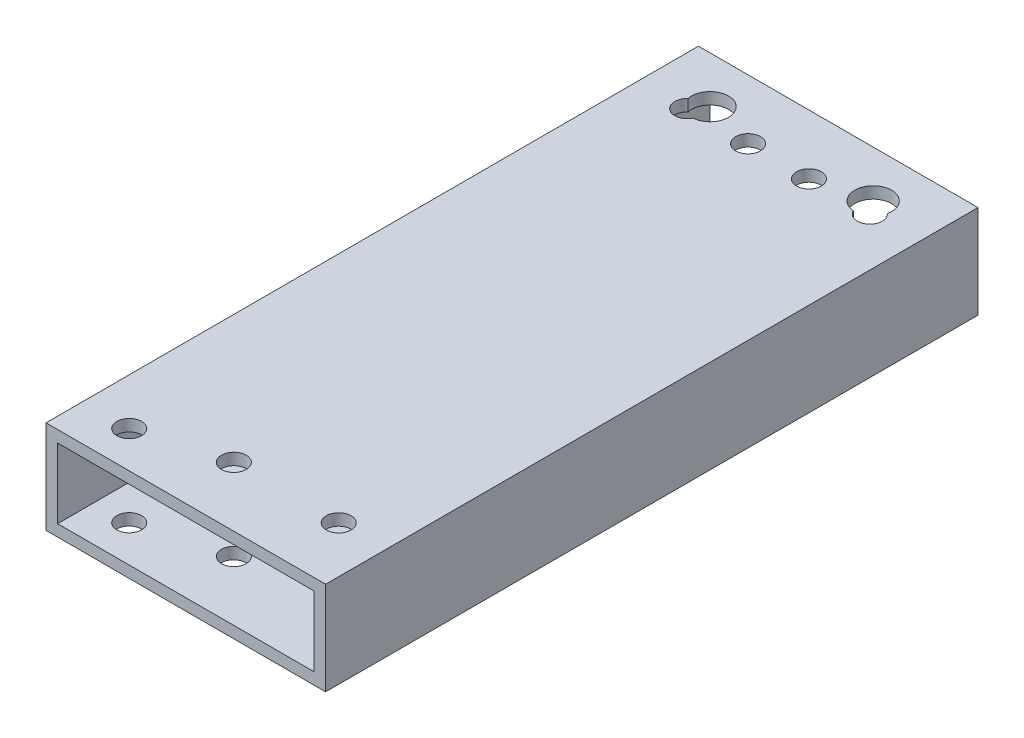
ISO-10303-21;
HEADER;
FILE_DESCRIPTION(('STEP AP214'),'2;1');
FILE_NAME('part.step','',(''),(''),'','','');
FILE_SCHEMA(('AUTOMOTIVE_DESIGN { 1 0 10303 214 1 1 1 1 }'));
ENDSEC;
DATA;
#1=APPLICATION_CONTEXT('core data for automotive mechanical design processes');
#2=APPLICATION_PROTOCOL_DEFINITION('international standard','automotive_design',2000,#1);
#3=PRODUCT_CONTEXT('',#1,'mechanical');
#4=PRODUCT('Part','Part','',(#3));
#5=PRODUCT_RELATED_PRODUCT_CATEGORY('part','',(#4));
#6=PRODUCT_DEFINITION_FORMATION('','',#4);
#7=PRODUCT_DEFINITION_CONTEXT('part definition',#1,'design');
#8=PRODUCT_DEFINITION('design','',#6,#7);
#9=PRODUCT_DEFINITION_SHAPE('','',#8);
#10=(LENGTH_UNIT() NAMED_UNIT(*) SI_UNIT(.MILLI.,.METRE.));
#11=(NAMED_UNIT(*) PLANE_ANGLE_UNIT() SI_UNIT($,.RADIAN.));
#12=(NAMED_UNIT(*) SI_UNIT($,.STERADIAN.) SOLID_ANGLE_UNIT());
#13=UNCERTAINTY_MEASURE_WITH_UNIT(LENGTH_MEASURE(1.E-05),#10,'distance_accuracy_value','');
#14=(GEOMETRIC_REPRESENTATION_CONTEXT(3) GLOBAL_UNCERTAINTY_ASSIGNED_CONTEXT((#13)) GLOBAL_UNIT_ASSIGNED_CONTEXT((#10,
#11,#12)) REPRESENTATION_CONTEXT('',''));
#15=CARTESIAN_POINT('',(0.,0.,0.));
#16=DIRECTION('',(0.,0.,1.));
#17=DIRECTION('',(1.,0.,0.));
#18=AXIS2_PLACEMENT_3D('',#15,#16,#17);
#19=CARTESIAN_POINT('',(0.,0.,177.8));
#20=DIRECTION('',(0.,0.,-1.));
#21=DIRECTION('',(-1.,0.,0.));
#22=AXIS2_PLACEMENT_3D('',#19,#20,#21);
#23=PLANE('',#22);
#24=DIRECTION('',(0.,-1.,0.));
#25=VECTOR('',#24,1.);
#26=CARTESIAN_POINT('',(0.,0.,177.8));
#27=LINE('',#26,#25);
#28=CARTESIAN_POINT('',(0.,25.4,177.8));
#29=VERTEX_POINT('',#28);
#30=CARTESIAN_POINT('',(0.,0.,177.8));
#31=VERTEX_POINT('',#30);
#32=EDGE_CURVE('E221',#29,#31,#27,.T.);
#33=ORIENTED_EDGE('',*,*,#32,.T.);
#34=DIRECTION('',(1.,0.,0.));
#35=VECTOR('',#34,1.);
#36=CARTESIAN_POINT('',(0.,0.,177.8));
#37=LINE('',#36,#35);
#38=CARTESIAN_POINT('',(76.2,0.,177.8));
#39=VERTEX_POINT('',#38);
#40=EDGE_CURVE('E224',#31,#39,#37,.T.);
#41=ORIENTED_EDGE('',*,*,#40,.T.);
#42=DIRECTION('',(0.,1.,0.));
#43=VECTOR('',#42,1.);
#44=CARTESIAN_POINT('',(76.2,0.,177.8));
#45=LINE('',#44,#43);
#46=CARTESIAN_POINT('',(76.2,25.4,177.8));
#47=VERTEX_POINT('',#46);
#48=EDGE_CURVE('E227',#39,#47,#45,.T.);
#49=ORIENTED_EDGE('',*,*,#48,.T.);
#50=DIRECTION('',(-1.,0.,0.));
#51=VECTOR('',#50,1.);
#52=CARTESIAN_POINT('',(0.,25.4,177.8));
#53=LINE('',#52,#51);
#54=EDGE_CURVE('E229',#47,#29,#53,.T.);
#55=ORIENTED_EDGE('',*,*,#54,.T.);
#56=EDGE_LOOP('',(#33,#41,#49,#55));
#57=FACE_BOUND('',#56,.T.);
#58=DIRECTION('',(0.,-1.,0.));
#59=VECTOR('',#58,1.);
#60=CARTESIAN_POINT('',(3.175,3.175,177.8));
#61=LINE('',#60,#59);
#62=CARTESIAN_POINT('',(3.175,22.225,177.8));
#63=VERTEX_POINT('',#62);
#64=CARTESIAN_POINT('',(3.175,3.175,177.8));
#65=VERTEX_POINT('',#64);
#66=EDGE_CURVE('E190',#63,#65,#61,.T.);
#67=ORIENTED_EDGE('',*,*,#66,.F.);
#68=DIRECTION('',(-1.,0.,0.));
#69=VECTOR('',#68,1.);
#70=CARTESIAN_POINT('',(3.175,22.225,177.8));
#71=LINE('',#70,#69);
#72=CARTESIAN_POINT('',(73.025,22.225,177.8));
#73=VERTEX_POINT('',#72);
#74=EDGE_CURVE('E198',#73,#63,#71,.T.);
#75=ORIENTED_EDGE('',*,*,#74,.F.);
#76=DIRECTION('',(0.,1.,0.));
#77=VECTOR('',#76,1.);
#78=CARTESIAN_POINT('',(73.025,3.175,177.8));
#79=LINE('',#78,#77);
#80=CARTESIAN_POINT('',(73.025,3.175,177.8));
#81=VERTEX_POINT('',#80);
#82=EDGE_CURVE('E195',#81,#73,#79,.T.);
#83=ORIENTED_EDGE('',*,*,#82,.F.);
#84=DIRECTION('',(1.,0.,0.));
#85=VECTOR('',#84,1.);
#86=CARTESIAN_POINT('',(3.175,3.175,177.8));
#87=LINE('',#86,#85);
#88=EDGE_CURVE('E192',#65,#81,#87,.T.);
#89=ORIENTED_EDGE('',*,*,#88,.F.);
#90=EDGE_LOOP('',(#67,#75,#83,#89));
#91=FACE_BOUND('',#90,.T.);
#92=ADVANCED_FACE('F32',(#57,#91),#23,.F.);
#93=CARTESIAN_POINT('',(0.,0.,0.));
#94=DIRECTION('',(0.,0.,-1.));
#95=DIRECTION('',(-1.,0.,0.));
#96=AXIS2_PLACEMENT_3D('',#93,#94,#95);
#97=PLANE('',#96);
#98=DIRECTION('',(0.,-1.,0.));
#99=VECTOR('',#98,1.);
#100=CARTESIAN_POINT('',(0.,0.,0.));
#101=LINE('',#100,#99);
#102=CARTESIAN_POINT('',(0.,25.4,0.));
#103=VERTEX_POINT('',#102);
#104=CARTESIAN_POINT('',(0.,0.,0.));
#105=VERTEX_POINT('',#104);
#106=EDGE_CURVE('E220',#103,#105,#101,.T.);
#107=ORIENTED_EDGE('',*,*,#106,.F.);
#108=DIRECTION('',(-1.,0.,0.));
#109=VECTOR('',#108,1.);
#110=CARTESIAN_POINT('',(0.,25.4,0.));
#111=LINE('',#110,#109);
#112=CARTESIAN_POINT('',(76.2,25.4,0.));
#113=VERTEX_POINT('',#112);
#114=EDGE_CURVE('E225',#113,#103,#111,.T.);
#115=ORIENTED_EDGE('',*,*,#114,.F.);
#116=DIRECTION('',(0.,1.,0.));
#117=VECTOR('',#116,1.);
#118=CARTESIAN_POINT('',(76.2,0.,0.));
#119=LINE('',#118,#117);
#120=CARTESIAN_POINT('',(76.2,0.,0.));
#121=VERTEX_POINT('',#120);
#122=EDGE_CURVE('E236',#121,#113,#119,.T.);
#123=ORIENTED_EDGE('',*,*,#122,.F.);
#124=DIRECTION('',(1.,0.,0.));
#125=VECTOR('',#124,1.);
#126=CARTESIAN_POINT('',(0.,0.,0.));
#127=LINE('',#126,#125);
#128=EDGE_CURVE('E234',#105,#121,#127,.T.);
#129=ORIENTED_EDGE('',*,*,#128,.F.);
#130=EDGE_LOOP('',(#107,#115,#123,#129));
#131=FACE_BOUND('',#130,.T.);
#132=DIRECTION('',(-1.,0.,0.));
#133=VECTOR('',#132,1.);
#134=CARTESIAN_POINT('',(3.175,22.225,0.));
#135=LINE('',#134,#133);
#136=CARTESIAN_POINT('',(73.025,22.225,0.));
#137=VERTEX_POINT('',#136);
#138=CARTESIAN_POINT('',(3.175,22.225,0.));
#139=VERTEX_POINT('',#138);
#140=EDGE_CURVE('E193',#137,#139,#135,.T.);
#141=ORIENTED_EDGE('',*,*,#140,.T.);
#142=DIRECTION('',(0.,-1.,0.));
#143=VECTOR('',#142,1.);
#144=CARTESIAN_POINT('',(3.175,3.175,0.));
#145=LINE('',#144,#143);
#146=CARTESIAN_POINT('',(3.175,3.175,0.));
#147=VERTEX_POINT('',#146);
#148=EDGE_CURVE('E189',#139,#147,#145,.T.);
#149=ORIENTED_EDGE('',*,*,#148,.T.);
#150=DIRECTION('',(1.,0.,0.));
#151=VECTOR('',#150,1.);
#152=CARTESIAN_POINT('',(3.175,3.175,0.));
#153=LINE('',#152,#151);
#154=CARTESIAN_POINT('',(73.025,3.175,0.));
#155=VERTEX_POINT('',#154);
#156=EDGE_CURVE('E203',#147,#155,#153,.T.);
#157=ORIENTED_EDGE('',*,*,#156,.T.);
#158=DIRECTION('',(0.,1.,0.));
#159=VECTOR('',#158,1.);
#160=CARTESIAN_POINT('',(73.025,3.175,0.));
#161=LINE('',#160,#159);
#162=EDGE_CURVE('E206',#155,#137,#161,.T.);
#163=ORIENTED_EDGE('',*,*,#162,.T.);
#164=EDGE_LOOP('',(#141,#149,#157,#163));
#165=FACE_BOUND('',#164,.T.);
#166=ADVANCED_FACE('F352',(#131,#165),#97,.T.);
#167=CARTESIAN_POINT('',(0.,0.,177.8));
#168=DIRECTION('',(1.,0.,0.));
#169=DIRECTION('',(0.,0.,-1.));
#170=AXIS2_PLACEMENT_3D('',#167,#168,#169);
#171=PLANE('',#170);
#172=ORIENTED_EDGE('',*,*,#106,.T.);
#173=DIRECTION('',(0.,0.,-1.));
#174=VECTOR('',#173,1.);
#175=CARTESIAN_POINT('',(0.,0.,177.8));
#176=LINE('',#175,#174);
#177=EDGE_CURVE('E247',#31,#105,#176,.T.);
#178=ORIENTED_EDGE('',*,*,#177,.F.);
#179=ORIENTED_EDGE('',*,*,#32,.F.);
#180=DIRECTION('',(0.,0.,-1.));
#181=VECTOR('',#180,1.);
#182=CARTESIAN_POINT('',(0.,25.4,177.8));
#183=LINE('',#182,#181);
#184=EDGE_CURVE('E231',#29,#103,#183,.T.);
#185=ORIENTED_EDGE('',*,*,#184,.T.);
#186=EDGE_LOOP('',(#172,#178,#179,#185));
#187=FACE_BOUND('',#186,.T.);
#188=ADVANCED_FACE('F34',(#187),#171,.F.);
#189=CARTESIAN_POINT('',(0.,0.,177.8));
#190=DIRECTION('',(0.,1.,0.));
#191=DIRECTION('',(0.,0.,1.));
#192=AXIS2_PLACEMENT_3D('',#189,#190,#191);
#193=PLANE('',#192);
#194=CARTESIAN_POINT('',(34.925,0.,161.531300000001));
#195=DIRECTION('',(0.,1.,0.));
#196=DIRECTION('',(0.,0.,1.));
#197=AXIS2_PLACEMENT_3D('',#194,#195,#196);
#198=CIRCLE('',#197,3.37819999999999);
#199=CARTESIAN_POINT('',(34.925,0.,164.909500000001));
#200=VERTEX_POINT('',#199);
#201=EDGE_CURVE('E273',#200,#200,#198,.T.);
#202=ORIENTED_EDGE('',*,*,#201,.T.);
#203=EDGE_LOOP('',(#202));
#204=FACE_BOUND('',#203,.T.);
#205=CARTESIAN_POINT('',(63.5000000000005,0.,161.531300000001));
#206=DIRECTION('',(0.,1.,0.));
#207=DIRECTION('',(0.,0.,1.));
#208=AXIS2_PLACEMENT_3D('',#205,#206,#207);
#209=CIRCLE('',#208,3.3782);
#210=CARTESIAN_POINT('',(63.5000000000005,0.,164.909500000001));
#211=VERTEX_POINT('',#210);
#212=EDGE_CURVE('E268',#211,#211,#209,.T.);
#213=ORIENTED_EDGE('',*,*,#212,.T.);
#214=EDGE_LOOP('',(#213));
#215=FACE_BOUND('',#214,.T.);
#216=CARTESIAN_POINT('',(12.6999999999994,0.,167.819500474202));
#217=DIRECTION('',(0.,-1.,0.));
#218=DIRECTION('',(0.,0.,-1.));
#219=AXIS2_PLACEMENT_3D('',#216,#217,#218);
#220=CIRCLE('',#219,3.37819999999999);
#221=CARTESIAN_POINT('',(12.6999999999994,0.,164.441300474202));
#222=VERTEX_POINT('',#221);
#223=EDGE_CURVE('E318',#222,#222,#220,.T.);
#224=ORIENTED_EDGE('',*,*,#223,.F.);
#225=EDGE_LOOP('',(#224));
#226=FACE_BOUND('',#225,.T.);
#227=CARTESIAN_POINT('',(29.80436,0.,16.2687));
#228=DIRECTION('',(0.,1.,0.));
#229=DIRECTION('',(0.,0.,1.));
#230=AXIS2_PLACEMENT_3D('',#227,#228,#229);
#231=CIRCLE('',#230,3.3782);
#232=CARTESIAN_POINT('',(29.80436,0.,19.6469));
#233=VERTEX_POINT('',#232);
#234=EDGE_CURVE('E255',#233,#233,#231,.T.);
#235=ORIENTED_EDGE('',*,*,#234,.T.);
#236=EDGE_LOOP('',(#235));
#237=FACE_BOUND('',#236,.T.);
#238=CARTESIAN_POINT('',(46.39564,0.,16.2687));
#239=DIRECTION('',(0.,1.,0.));
#240=DIRECTION('',(0.,0.,1.));
#241=AXIS2_PLACEMENT_3D('',#238,#239,#240);
#242=CIRCLE('',#241,3.3782);
#243=CARTESIAN_POINT('',(46.39564,0.,19.6469));
#244=VERTEX_POINT('',#243);
#245=EDGE_CURVE('E161',#244,#244,#242,.T.);
#246=ORIENTED_EDGE('',*,*,#245,.T.);
#247=EDGE_LOOP('',(#246));
#248=FACE_BOUND('',#247,.T.);
#249=CARTESIAN_POINT('',(62.98692,0.,16.2687));
#250=DIRECTION('',(0.,1.,0.));
#251=DIRECTION('',(0.,0.,1.));
#252=AXIS2_PLACEMENT_3D('',#249,#250,#251);
#253=CIRCLE('',#252,3.37820000000001);
#254=CARTESIAN_POINT('',(59.9397696653714,0.,17.7271615449756));
#255=VERTEX_POINT('',#254);
#256=CARTESIAN_POINT('',(65.2534245874837,0.,13.7636666279837));
#257=VERTEX_POINT('',#256);
#258=EDGE_CURVE('E153',#255,#257,#253,.T.);
#259=ORIENTED_EDGE('',*,*,#258,.T.);
#260=CARTESIAN_POINT('',(60.325,0.,12.7));
#261=DIRECTION('',(0.,-1.,0.));
#262=DIRECTION('',(0.,0.,-1.));
#263=AXIS2_PLACEMENT_3D('',#260,#261,#262);
#264=CIRCLE('',#263,5.04189999999999);
#265=EDGE_CURVE('E55',#255,#257,#264,.T.);
#266=ORIENTED_EDGE('',*,*,#265,.F.);
#267=EDGE_LOOP('',(#259,#266));
#268=FACE_BOUND('',#267,.T.);
#269=CARTESIAN_POINT('',(13.21308,0.,16.2687));
#270=DIRECTION('',(0.,1.,0.));
#271=DIRECTION('',(0.,0.,1.));
#272=AXIS2_PLACEMENT_3D('',#269,#270,#271);
#273=CIRCLE('',#272,3.3782);
#274=CARTESIAN_POINT('',(10.9465754125163,0.,13.7636666279837));
#275=VERTEX_POINT('',#274);
#276=CARTESIAN_POINT('',(16.2602303346286,0.,17.7271615449756));
#277=VERTEX_POINT('',#276);
#278=EDGE_CURVE('E180',#275,#277,#273,.T.);
#279=ORIENTED_EDGE('',*,*,#278,.T.);
#280=CARTESIAN_POINT('',(15.875,0.,12.7));
#281=DIRECTION('',(0.,-1.,0.));
#282=DIRECTION('',(0.,0.,-1.));
#283=AXIS2_PLACEMENT_3D('',#280,#281,#282);
#284=CIRCLE('',#283,5.0419);
#285=EDGE_CURVE('E296',#275,#277,#284,.T.);
#286=ORIENTED_EDGE('',*,*,#285,.F.);
#287=EDGE_LOOP('',(#279,#286));
#288=FACE_BOUND('',#287,.T.);
#289=ORIENTED_EDGE('',*,*,#128,.T.);
#290=DIRECTION('',(0.,0.,-1.));
#291=VECTOR('',#290,1.);
#292=CARTESIAN_POINT('',(76.2,0.,177.8));
#293=LINE('',#292,#291);
#294=EDGE_CURVE('E244',#39,#121,#293,.T.);
#295=ORIENTED_EDGE('',*,*,#294,.F.);
#296=ORIENTED_EDGE('',*,*,#40,.F.);
#297=ORIENTED_EDGE('',*,*,#177,.T.);
#298=EDGE_LOOP('',(#289,#295,#296,#297));
#299=FACE_BOUND('',#298,.T.);
#300=ADVANCED_FACE('F151',(#204,#215,#226,#237,#248,#268,#288,#299),#193,.F.);
#301=CARTESIAN_POINT('',(76.2,0.,177.8));
#302=DIRECTION('',(-1.,0.,0.));
#303=DIRECTION('',(0.,0.,1.));
#304=AXIS2_PLACEMENT_3D('',#301,#302,#303);
#305=PLANE('',#304);
#306=ORIENTED_EDGE('',*,*,#122,.T.);
#307=DIRECTION('',(0.,0.,-1.));
#308=VECTOR('',#307,1.);
#309=CARTESIAN_POINT('',(76.2,25.4,177.8));
#310=LINE('',#309,#308);
#311=EDGE_CURVE('E241',#47,#113,#310,.T.);
#312=ORIENTED_EDGE('',*,*,#311,.F.);
#313=ORIENTED_EDGE('',*,*,#48,.F.);
#314=ORIENTED_EDGE('',*,*,#294,.T.);
#315=EDGE_LOOP('',(#306,#312,#313,#314));
#316=FACE_BOUND('',#315,.T.);
#317=ADVANCED_FACE('F368',(#316),#305,.F.);
#318=CARTESIAN_POINT('',(0.,25.4,177.8));
#319=DIRECTION('',(0.,-1.,0.));
#320=DIRECTION('',(0.,0.,-1.));
#321=AXIS2_PLACEMENT_3D('',#318,#319,#320);
#322=PLANE('',#321);
#323=CARTESIAN_POINT('',(34.925,25.4,161.531300000001));
#324=DIRECTION('',(0.,1.,0.));
#325=DIRECTION('',(0.,0.,1.));
#326=AXIS2_PLACEMENT_3D('',#323,#324,#325);
#327=CIRCLE('',#326,3.37819999999999);
#328=CARTESIAN_POINT('',(34.925,25.4,164.909500000001));
#329=VERTEX_POINT('',#328);
#330=EDGE_CURVE('E304',#329,#329,#327,.T.);
#331=ORIENTED_EDGE('',*,*,#330,.F.);
#332=EDGE_LOOP('',(#331));
#333=FACE_BOUND('',#332,.T.);
#334=CARTESIAN_POINT('',(63.5000000000005,25.4,161.531300000001));
#335=DIRECTION('',(0.,1.,0.));
#336=DIRECTION('',(0.,0.,1.));
#337=AXIS2_PLACEMENT_3D('',#334,#335,#336);
#338=CIRCLE('',#337,3.3782);
#339=CARTESIAN_POINT('',(63.5000000000005,25.4,164.909500000001));
#340=VERTEX_POINT('',#339);
#341=EDGE_CURVE('E311',#340,#340,#338,.T.);
#342=ORIENTED_EDGE('',*,*,#341,.F.);
#343=EDGE_LOOP('',(#342));
#344=FACE_BOUND('',#343,.T.);
#345=CARTESIAN_POINT('',(12.6999999999994,25.4,167.819500474202));
#346=DIRECTION('',(0.,-1.,0.));
#347=DIRECTION('',(0.,0.,-1.));
#348=AXIS2_PLACEMENT_3D('',#345,#346,#347);
#349=CIRCLE('',#348,3.37819999999999);
#350=CARTESIAN_POINT('',(12.6999999999994,25.4,164.441300474202));
#351=VERTEX_POINT('',#350);
#352=EDGE_CURVE('E263',#351,#351,#349,.T.);
#353=ORIENTED_EDGE('',*,*,#352,.T.);
#354=EDGE_LOOP('',(#353));
#355=FACE_BOUND('',#354,.T.);
#356=CARTESIAN_POINT('',(29.80436,25.4,16.2687));
#357=DIRECTION('',(0.,1.,0.));
#358=DIRECTION('',(0.,0.,1.));
#359=AXIS2_PLACEMENT_3D('',#356,#357,#358);
#360=CIRCLE('',#359,3.3782);
#361=CARTESIAN_POINT('',(29.80436,25.4,19.6469));
#362=VERTEX_POINT('',#361);
#363=EDGE_CURVE('E327',#362,#362,#360,.T.);
#364=ORIENTED_EDGE('',*,*,#363,.F.);
#365=EDGE_LOOP('',(#364));
#366=FACE_BOUND('',#365,.T.);
#367=CARTESIAN_POINT('',(46.39564,25.4,16.2687));
#368=DIRECTION('',(0.,1.,0.));
#369=DIRECTION('',(0.,0.,1.));
#370=AXIS2_PLACEMENT_3D('',#367,#368,#369);
#371=CIRCLE('',#370,3.3782);
#372=CARTESIAN_POINT('',(46.39564,25.4,19.6469));
#373=VERTEX_POINT('',#372);
#374=EDGE_CURVE('E157',#373,#373,#371,.T.);
#375=ORIENTED_EDGE('',*,*,#374,.F.);
#376=EDGE_LOOP('',(#375));
#377=FACE_BOUND('',#376,.T.);
#378=CARTESIAN_POINT('',(62.98692,25.4,16.2687));
#379=DIRECTION('',(0.,1.,0.));
#380=DIRECTION('',(0.,0.,1.));
#381=AXIS2_PLACEMENT_3D('',#378,#379,#380);
#382=CIRCLE('',#381,3.37820000000001);
#383=CARTESIAN_POINT('',(59.9397696653714,25.4,17.7271615449756));
#384=VERTEX_POINT('',#383);
#385=CARTESIAN_POINT('',(65.2534245874837,25.4,13.7636666279837));
#386=VERTEX_POINT('',#385);
#387=EDGE_CURVE('E158',#384,#386,#382,.T.);
#388=ORIENTED_EDGE('',*,*,#387,.F.);
#389=CARTESIAN_POINT('',(60.325,25.4,12.7));
#390=DIRECTION('',(0.,-1.,0.));
#391=DIRECTION('',(0.,0.,-1.));
#392=AXIS2_PLACEMENT_3D('',#389,#390,#391);
#393=CIRCLE('',#392,5.04189999999999);
#394=EDGE_CURVE('E154',#384,#386,#393,.T.);
#395=ORIENTED_EDGE('',*,*,#394,.T.);
#396=EDGE_LOOP('',(#388,#395));
#397=FACE_BOUND('',#396,.T.);
#398=CARTESIAN_POINT('',(13.21308,25.4,16.2687));
#399=DIRECTION('',(0.,1.,0.));
#400=DIRECTION('',(0.,0.,1.));
#401=AXIS2_PLACEMENT_3D('',#398,#399,#400);
#402=CIRCLE('',#401,3.3782);
#403=CARTESIAN_POINT('',(10.9465754125163,25.4,13.7636666279837));
#404=VERTEX_POINT('',#403);
#405=CARTESIAN_POINT('',(16.2602303346286,25.4,17.7271615449756));
#406=VERTEX_POINT('',#405);
#407=EDGE_CURVE('E179',#404,#406,#402,.T.);
#408=ORIENTED_EDGE('',*,*,#407,.F.);
#409=CARTESIAN_POINT('',(15.875,25.4,12.7));
#410=DIRECTION('',(0.,-1.,0.));
#411=DIRECTION('',(0.,0.,-1.));
#412=AXIS2_PLACEMENT_3D('',#409,#410,#411);
#413=CIRCLE('',#412,5.0419);
#414=EDGE_CURVE('E290',#404,#406,#413,.T.);
#415=ORIENTED_EDGE('',*,*,#414,.T.);
#416=EDGE_LOOP('',(#408,#415));
#417=FACE_BOUND('',#416,.T.);
#418=ORIENTED_EDGE('',*,*,#114,.T.);
#419=ORIENTED_EDGE('',*,*,#184,.F.);
#420=ORIENTED_EDGE('',*,*,#54,.F.);
#421=ORIENTED_EDGE('',*,*,#311,.T.);
#422=EDGE_LOOP('',(#418,#419,#420,#421));
#423=FACE_BOUND('',#422,.T.);
#424=ADVANCED_FACE('F365',(#333,#344,#355,#366,#377,#397,#417,#423),#322,.F.);
#425=CARTESIAN_POINT('',(3.175,3.175,177.8));
#426=DIRECTION('',(1.,0.,0.));
#427=DIRECTION('',(0.,0.,-1.));
#428=AXIS2_PLACEMENT_3D('',#425,#426,#427);
#429=PLANE('',#428);
#430=ORIENTED_EDGE('',*,*,#148,.F.);
#431=DIRECTION('',(0.,0.,-1.));
#432=VECTOR('',#431,1.);
#433=CARTESIAN_POINT('',(3.175,22.225,177.8));
#434=LINE('',#433,#432);
#435=EDGE_CURVE('E200',#63,#139,#434,.T.);
#436=ORIENTED_EDGE('',*,*,#435,.F.);
#437=ORIENTED_EDGE('',*,*,#66,.T.);
#438=DIRECTION('',(0.,0.,-1.));
#439=VECTOR('',#438,1.);
#440=CARTESIAN_POINT('',(3.175,3.175,177.8));
#441=LINE('',#440,#439);
#442=EDGE_CURVE('E217',#65,#147,#441,.T.);
#443=ORIENTED_EDGE('',*,*,#442,.T.);
#444=EDGE_LOOP('',(#430,#436,#437,#443));
#445=FACE_BOUND('',#444,.T.);
#446=ADVANCED_FACE('F362',(#445),#429,.T.);
#447=CARTESIAN_POINT('',(3.175,3.175,177.8));
#448=DIRECTION('',(0.,1.,0.));
#449=DIRECTION('',(0.,0.,1.));
#450=AXIS2_PLACEMENT_3D('',#447,#448,#449);
#451=PLANE('',#450);
#452=CARTESIAN_POINT('',(60.325,3.175,12.7));
#453=DIRECTION('',(0.,1.,0.));
#454=DIRECTION('',(0.,0.,1.));
#455=AXIS2_PLACEMENT_3D('',#452,#453,#454);
#456=CIRCLE('',#455,5.04189999999999);
#457=CARTESIAN_POINT('',(65.2534245874837,3.175,13.7636666279837));
#458=VERTEX_POINT('',#457);
#459=CARTESIAN_POINT('',(59.9397696653714,3.175,17.7271615449756));
#460=VERTEX_POINT('',#459);
#461=EDGE_CURVE('E144',#458,#460,#456,.T.);
#462=ORIENTED_EDGE('',*,*,#461,.F.);
#463=CARTESIAN_POINT('',(62.98692,3.175,16.2687));
#464=DIRECTION('',(0.,1.,0.));
#465=DIRECTION('',(0.,0.,1.));
#466=AXIS2_PLACEMENT_3D('',#463,#464,#465);
#467=CIRCLE('',#466,3.37820000000001);
#468=EDGE_CURVE('E168',#460,#458,#467,.T.);
#469=ORIENTED_EDGE('',*,*,#468,.F.);
#470=EDGE_LOOP('',(#462,#469));
#471=FACE_BOUND('',#470,.T.);
#472=CARTESIAN_POINT('',(15.875,3.175,12.7));
#473=DIRECTION('',(0.,1.,0.));
#474=DIRECTION('',(0.,0.,1.));
#475=AXIS2_PLACEMENT_3D('',#472,#473,#474);
#476=CIRCLE('',#475,5.0419);
#477=CARTESIAN_POINT('',(16.2602303346286,3.175,17.7271615449756));
#478=VERTEX_POINT('',#477);
#479=CARTESIAN_POINT('',(10.9465754125163,3.175,13.7636666279837));
#480=VERTEX_POINT('',#479);
#481=EDGE_CURVE('E288',#478,#480,#476,.T.);
#482=ORIENTED_EDGE('',*,*,#481,.F.);
#483=CARTESIAN_POINT('',(13.21308,3.175,16.2687));
#484=DIRECTION('',(0.,1.,0.));
#485=DIRECTION('',(0.,0.,1.));
#486=AXIS2_PLACEMENT_3D('',#483,#484,#485);
#487=CIRCLE('',#486,3.3782);
#488=EDGE_CURVE('E186',#480,#478,#487,.T.);
#489=ORIENTED_EDGE('',*,*,#488,.F.);
#490=EDGE_LOOP('',(#482,#489));
#491=FACE_BOUND('',#490,.T.);
#492=CARTESIAN_POINT('',(34.925,3.175,161.531300000001));
#493=DIRECTION('',(0.,1.,0.));
#494=DIRECTION('',(0.,0.,1.));
#495=AXIS2_PLACEMENT_3D('',#492,#493,#494);
#496=CIRCLE('',#495,3.37819999999999);
#497=CARTESIAN_POINT('',(34.925,3.175,164.909500000001));
#498=VERTEX_POINT('',#497);
#499=EDGE_CURVE('E272',#498,#498,#496,.T.);
#500=ORIENTED_EDGE('',*,*,#499,.F.);
#501=EDGE_LOOP('',(#500));
#502=FACE_BOUND('',#501,.T.);
#503=CARTESIAN_POINT('',(63.5000000000005,3.175,161.531300000001));
#504=DIRECTION('',(0.,1.,0.));
#505=DIRECTION('',(0.,0.,1.));
#506=AXIS2_PLACEMENT_3D('',#503,#504,#505);
#507=CIRCLE('',#506,3.3782);
#508=CARTESIAN_POINT('',(63.5000000000005,3.175,164.909500000001));
#509=VERTEX_POINT('',#508);
#510=EDGE_CURVE('E267',#509,#509,#507,.T.);
#511=ORIENTED_EDGE('',*,*,#510,.F.);
#512=EDGE_LOOP('',(#511));
#513=FACE_BOUND('',#512,.T.);
#514=CARTESIAN_POINT('',(12.6999999999994,3.175,167.819500474202));
#515=DIRECTION('',(0.,1.,0.));
#516=DIRECTION('',(0.,0.,1.));
#517=AXIS2_PLACEMENT_3D('',#514,#515,#516);
#518=CIRCLE('',#517,3.37819999999999);
#519=CARTESIAN_POINT('',(12.6999999999994,3.175,171.197700474202));
#520=VERTEX_POINT('',#519);
#521=EDGE_CURVE('E164',#520,#520,#518,.T.);
#522=ORIENTED_EDGE('',*,*,#521,.F.);
#523=EDGE_LOOP('',(#522));
#524=FACE_BOUND('',#523,.T.);
#525=CARTESIAN_POINT('',(29.80436,3.175,16.2687));
#526=DIRECTION('',(0.,1.,0.));
#527=DIRECTION('',(0.,0.,1.));
#528=AXIS2_PLACEMENT_3D('',#525,#526,#527);
#529=CIRCLE('',#528,3.3782);
#530=CARTESIAN_POINT('',(29.80436,3.175,19.6469));
#531=VERTEX_POINT('',#530);
#532=EDGE_CURVE('E176',#531,#531,#529,.T.);
#533=ORIENTED_EDGE('',*,*,#532,.F.);
#534=EDGE_LOOP('',(#533));
#535=FACE_BOUND('',#534,.T.);
#536=CARTESIAN_POINT('',(46.39564,3.175,16.2687));
#537=DIRECTION('',(0.,1.,0.));
#538=DIRECTION('',(0.,0.,1.));
#539=AXIS2_PLACEMENT_3D('',#536,#537,#538);
#540=CIRCLE('',#539,3.3782);
#541=CARTESIAN_POINT('',(46.39564,3.175,19.6469));
#542=VERTEX_POINT('',#541);
#543=EDGE_CURVE('E172',#542,#542,#540,.T.);
#544=ORIENTED_EDGE('',*,*,#543,.F.);
#545=EDGE_LOOP('',(#544));
#546=FACE_BOUND('',#545,.T.);
#547=ORIENTED_EDGE('',*,*,#156,.F.);
#548=ORIENTED_EDGE('',*,*,#442,.F.);
#549=ORIENTED_EDGE('',*,*,#88,.T.);
#550=DIRECTION('',(0.,0.,-1.));
#551=VECTOR('',#550,1.);
#552=CARTESIAN_POINT('',(73.025,3.175,177.8));
#553=LINE('',#552,#551);
#554=EDGE_CURVE('E215',#81,#155,#553,.T.);
#555=ORIENTED_EDGE('',*,*,#554,.T.);
#556=EDGE_LOOP('',(#547,#548,#549,#555));
#557=FACE_BOUND('',#556,.T.);
#558=ADVANCED_FACE('F286',(#471,#491,#502,#513,#524,#535,#546,#557),#451,.T.);
#559=CARTESIAN_POINT('',(73.025,3.175,177.8));
#560=DIRECTION('',(-1.,0.,0.));
#561=DIRECTION('',(0.,0.,1.));
#562=AXIS2_PLACEMENT_3D('',#559,#560,#561);
#563=PLANE('',#562);
#564=ORIENTED_EDGE('',*,*,#162,.F.);
#565=ORIENTED_EDGE('',*,*,#554,.F.);
#566=ORIENTED_EDGE('',*,*,#82,.T.);
#567=DIRECTION('',(0.,0.,-1.));
#568=VECTOR('',#567,1.);
#569=CARTESIAN_POINT('',(73.025,22.225,177.8));
#570=LINE('',#569,#568);
#571=EDGE_CURVE('E213',#73,#137,#570,.T.);
#572=ORIENTED_EDGE('',*,*,#571,.T.);
#573=EDGE_LOOP('',(#564,#565,#566,#572));
#574=FACE_BOUND('',#573,.T.);
#575=ADVANCED_FACE('F443',(#574),#563,.T.);
#576=CARTESIAN_POINT('',(3.175,22.225,177.8));
#577=DIRECTION('',(0.,-1.,0.));
#578=DIRECTION('',(0.,0.,-1.));
#579=AXIS2_PLACEMENT_3D('',#576,#577,#578);
#580=PLANE('',#579);
#581=CARTESIAN_POINT('',(60.325,22.225,12.7));
#582=DIRECTION('',(0.,-1.,0.));
#583=DIRECTION('',(0.,0.,-1.));
#584=AXIS2_PLACEMENT_3D('',#581,#582,#583);
#585=CIRCLE('',#584,5.04189999999999);
#586=CARTESIAN_POINT('',(59.9397696653714,22.225,17.7271615449756));
#587=VERTEX_POINT('',#586);
#588=CARTESIAN_POINT('',(65.2534245874837,22.225,13.7636666279837));
#589=VERTEX_POINT('',#588);
#590=EDGE_CURVE('E47',#587,#589,#585,.T.);
#591=ORIENTED_EDGE('',*,*,#590,.F.);
#592=CARTESIAN_POINT('',(62.98692,22.225,16.2687));
#593=DIRECTION('',(0.,-1.,0.));
#594=DIRECTION('',(0.,0.,-1.));
#595=AXIS2_PLACEMENT_3D('',#592,#593,#594);
#596=CIRCLE('',#595,3.37820000000001);
#597=EDGE_CURVE('E171',#589,#587,#596,.T.);
#598=ORIENTED_EDGE('',*,*,#597,.F.);
#599=EDGE_LOOP('',(#591,#598));
#600=FACE_BOUND('',#599,.T.);
#601=CARTESIAN_POINT('',(15.875,22.225,12.7));
#602=DIRECTION('',(0.,-1.,0.));
#603=DIRECTION('',(0.,0.,-1.));
#604=AXIS2_PLACEMENT_3D('',#601,#602,#603);
#605=CIRCLE('',#604,5.0419);
#606=CARTESIAN_POINT('',(10.9465754125163,22.225,13.7636666279837));
#607=VERTEX_POINT('',#606);
#608=CARTESIAN_POINT('',(16.2602303346286,22.225,17.7271615449756));
#609=VERTEX_POINT('',#608);
#610=EDGE_CURVE('E293',#607,#609,#605,.T.);
#611=ORIENTED_EDGE('',*,*,#610,.F.);
#612=CARTESIAN_POINT('',(13.21308,22.225,16.2687));
#613=DIRECTION('',(0.,-1.,0.));
#614=DIRECTION('',(0.,0.,-1.));
#615=AXIS2_PLACEMENT_3D('',#612,#613,#614);
#616=CIRCLE('',#615,3.3782);
#617=EDGE_CURVE('E183',#609,#607,#616,.T.);
#618=ORIENTED_EDGE('',*,*,#617,.F.);
#619=EDGE_LOOP('',(#611,#618));
#620=FACE_BOUND('',#619,.T.);
#621=CARTESIAN_POINT('',(34.925,22.225,161.531300000001));
#622=DIRECTION('',(0.,-1.,0.));
#623=DIRECTION('',(0.,0.,-1.));
#624=AXIS2_PLACEMENT_3D('',#621,#622,#623);
#625=CIRCLE('',#624,3.37819999999999);
#626=CARTESIAN_POINT('',(34.925,22.225,158.153100000001));
#627=VERTEX_POINT('',#626);
#628=EDGE_CURVE('E269',#627,#627,#625,.T.);
#629=ORIENTED_EDGE('',*,*,#628,.F.);
#630=EDGE_LOOP('',(#629));
#631=FACE_BOUND('',#630,.T.);
#632=CARTESIAN_POINT('',(63.5000000000005,22.225,161.531300000001));
#633=DIRECTION('',(0.,-1.,0.));
#634=DIRECTION('',(0.,0.,-1.));
#635=AXIS2_PLACEMENT_3D('',#632,#633,#634);
#636=CIRCLE('',#635,3.3782);
#637=CARTESIAN_POINT('',(63.5000000000005,22.225,158.153100000001));
#638=VERTEX_POINT('',#637);
#639=EDGE_CURVE('E264',#638,#638,#636,.T.);
#640=ORIENTED_EDGE('',*,*,#639,.F.);
#641=EDGE_LOOP('',(#640));
#642=FACE_BOUND('',#641,.T.);
#643=CARTESIAN_POINT('',(12.6999999999994,22.225,167.819500474202));
#644=DIRECTION('',(0.,-1.,0.));
#645=DIRECTION('',(0.,0.,-1.));
#646=AXIS2_PLACEMENT_3D('',#643,#644,#645);
#647=CIRCLE('',#646,3.37819999999999);
#648=CARTESIAN_POINT('',(12.6999999999994,22.225,164.441300474202));
#649=VERTEX_POINT('',#648);
#650=EDGE_CURVE('E260',#649,#649,#647,.T.);
#651=ORIENTED_EDGE('',*,*,#650,.F.);
#652=EDGE_LOOP('',(#651));
#653=FACE_BOUND('',#652,.T.);
#654=CARTESIAN_POINT('',(29.80436,22.225,16.2687));
#655=DIRECTION('',(0.,-1.,0.));
#656=DIRECTION('',(0.,0.,-1.));
#657=AXIS2_PLACEMENT_3D('',#654,#655,#656);
#658=CIRCLE('',#657,3.3782);
#659=CARTESIAN_POINT('',(29.80436,22.225,12.8905));
#660=VERTEX_POINT('',#659);
#661=EDGE_CURVE('E175',#660,#660,#658,.T.);
#662=ORIENTED_EDGE('',*,*,#661,.F.);
#663=EDGE_LOOP('',(#662));
#664=FACE_BOUND('',#663,.T.);
#665=CARTESIAN_POINT('',(46.39564,22.225,16.2687));
#666=DIRECTION('',(0.,-1.,0.));
#667=DIRECTION('',(0.,0.,-1.));
#668=AXIS2_PLACEMENT_3D('',#665,#666,#667);
#669=CIRCLE('',#668,3.3782);
#670=CARTESIAN_POINT('',(46.39564,22.225,12.8905));
#671=VERTEX_POINT('',#670);
#672=EDGE_CURVE('E170',#671,#671,#669,.T.);
#673=ORIENTED_EDGE('',*,*,#672,.F.);
#674=EDGE_LOOP('',(#673));
#675=FACE_BOUND('',#674,.T.);
#676=ORIENTED_EDGE('',*,*,#140,.F.);
#677=ORIENTED_EDGE('',*,*,#571,.F.);
#678=ORIENTED_EDGE('',*,*,#74,.T.);
#679=ORIENTED_EDGE('',*,*,#435,.T.);
#680=EDGE_LOOP('',(#676,#677,#678,#679));
#681=FACE_BOUND('',#680,.T.);
#682=ADVANCED_FACE('F432',(#600,#620,#631,#642,#653,#664,#675,#681),#580,.T.);
#683=CARTESIAN_POINT('',(13.21308,0.,16.2687));
#684=DIRECTION('',(0.,1.,0.));
#685=DIRECTION('',(0.,0.,1.));
#686=AXIS2_PLACEMENT_3D('',#683,#684,#685);
#687=CYLINDRICAL_SURFACE('',#686,3.3782);
#688=ORIENTED_EDGE('',*,*,#617,.T.);
#689=DIRECTION('',(0.,-1.,0.));
#690=VECTOR('',#689,1.);
#691=CARTESIAN_POINT('',(10.9465754125163,12.7,13.7636666279837));
#692=LINE('',#691,#690);
#693=EDGE_CURVE('E301',#607,#404,#692,.F.);
#694=ORIENTED_EDGE('',*,*,#693,.T.);
#695=ORIENTED_EDGE('',*,*,#407,.T.);
#696=DIRECTION('',(0.,-1.,0.));
#697=VECTOR('',#696,1.);
#698=CARTESIAN_POINT('',(16.2602303346286,12.7,17.7271615449756));
#699=LINE('',#698,#697);
#700=EDGE_CURVE('E289',#406,#609,#699,.T.);
#701=ORIENTED_EDGE('',*,*,#700,.T.);
#702=EDGE_LOOP('',(#688,#694,#695,#701));
#703=FACE_BOUND('',#702,.T.);
#704=ADVANCED_FACE('F450',(#703),#687,.F.);
#705=ORIENTED_EDGE('',*,*,#278,.F.);
#706=DIRECTION('',(0.,-1.,0.));
#707=VECTOR('',#706,1.);
#708=CARTESIAN_POINT('',(10.9465754125163,12.7,13.7636666279837));
#709=LINE('',#708,#707);
#710=EDGE_CURVE('E276',#275,#480,#709,.F.);
#711=ORIENTED_EDGE('',*,*,#710,.T.);
#712=ORIENTED_EDGE('',*,*,#488,.T.);
#713=DIRECTION('',(0.,-1.,0.));
#714=VECTOR('',#713,1.);
#715=CARTESIAN_POINT('',(16.2602303346286,12.7,17.7271615449756));
#716=LINE('',#715,#714);
#717=EDGE_CURVE('E250',#478,#277,#716,.T.);
#718=ORIENTED_EDGE('',*,*,#717,.T.);
#719=EDGE_LOOP('',(#705,#711,#712,#718));
#720=FACE_BOUND('',#719,.T.);
#721=ADVANCED_FACE('F281',(#720),#687,.F.);
#722=CARTESIAN_POINT('',(62.98692,0.,16.2687));
#723=DIRECTION('',(0.,1.,0.));
#724=DIRECTION('',(0.,0.,1.));
#725=AXIS2_PLACEMENT_3D('',#722,#723,#724);
#726=CYLINDRICAL_SURFACE('',#725,3.37820000000001);
#727=ORIENTED_EDGE('',*,*,#597,.T.);
#728=DIRECTION('',(0.,-1.,0.));
#729=VECTOR('',#728,1.);
#730=CARTESIAN_POINT('',(59.9397696653714,12.7,17.7271615449756));
#731=LINE('',#730,#729);
#732=EDGE_CURVE('E464',#587,#384,#731,.F.);
#733=ORIENTED_EDGE('',*,*,#732,.T.);
#734=ORIENTED_EDGE('',*,*,#387,.T.);
#735=DIRECTION('',(0.,-1.,0.));
#736=VECTOR('',#735,1.);
#737=CARTESIAN_POINT('',(65.2534245874837,12.7,13.7636666279836));
#738=LINE('',#737,#736);
#739=EDGE_CURVE('E465',#386,#589,#738,.T.);
#740=ORIENTED_EDGE('',*,*,#739,.T.);
#741=EDGE_LOOP('',(#727,#733,#734,#740));
#742=FACE_BOUND('',#741,.T.);
#743=ADVANCED_FACE('F348',(#742),#726,.F.);
#744=CARTESIAN_POINT('',(46.39564,0.,16.2687));
#745=DIRECTION('',(0.,1.,0.));
#746=DIRECTION('',(0.,0.,1.));
#747=AXIS2_PLACEMENT_3D('',#744,#745,#746);
#748=CYLINDRICAL_SURFACE('',#747,3.3782);
#749=ORIENTED_EDGE('',*,*,#672,.T.);
#750=EDGE_LOOP('',(#749));
#751=FACE_BOUND('',#750,.T.);
#752=ORIENTED_EDGE('',*,*,#374,.T.);
#753=EDGE_LOOP('',(#752));
#754=FACE_BOUND('',#753,.T.);
#755=ADVANCED_FACE('F338',(#751,#754),#748,.F.);
#756=CARTESIAN_POINT('',(29.80436,0.,16.2687));
#757=DIRECTION('',(0.,1.,0.));
#758=DIRECTION('',(0.,0.,1.));
#759=AXIS2_PLACEMENT_3D('',#756,#757,#758);
#760=CYLINDRICAL_SURFACE('',#759,3.3782);
#761=ORIENTED_EDGE('',*,*,#661,.T.);
#762=EDGE_LOOP('',(#761));
#763=FACE_BOUND('',#762,.T.);
#764=ORIENTED_EDGE('',*,*,#363,.T.);
#765=EDGE_LOOP('',(#764));
#766=FACE_BOUND('',#765,.T.);
#767=ADVANCED_FACE('F346',(#763,#766),#760,.F.);
#768=ORIENTED_EDGE('',*,*,#258,.F.);
#769=DIRECTION('',(0.,-1.,0.));
#770=VECTOR('',#769,1.);
#771=CARTESIAN_POINT('',(59.9397696653714,12.7,17.7271615449756));
#772=LINE('',#771,#770);
#773=EDGE_CURVE('E11',#255,#460,#772,.F.);
#774=ORIENTED_EDGE('',*,*,#773,.T.);
#775=ORIENTED_EDGE('',*,*,#468,.T.);
#776=DIRECTION('',(0.,-1.,0.));
#777=VECTOR('',#776,1.);
#778=CARTESIAN_POINT('',(65.2534245874837,12.7,13.7636666279836));
#779=LINE('',#778,#777);
#780=EDGE_CURVE('E40',#458,#257,#779,.T.);
#781=ORIENTED_EDGE('',*,*,#780,.T.);
#782=EDGE_LOOP('',(#768,#774,#775,#781));
#783=FACE_BOUND('',#782,.T.);
#784=ADVANCED_FACE('F156',(#783),#726,.F.);
#785=ORIENTED_EDGE('',*,*,#543,.T.);
#786=EDGE_LOOP('',(#785));
#787=FACE_BOUND('',#786,.T.);
#788=ORIENTED_EDGE('',*,*,#245,.F.);
#789=EDGE_LOOP('',(#788));
#790=FACE_BOUND('',#789,.T.);
#791=ADVANCED_FACE('F333',(#787,#790),#748,.F.);
#792=ORIENTED_EDGE('',*,*,#532,.T.);
#793=EDGE_LOOP('',(#792));
#794=FACE_BOUND('',#793,.T.);
#795=ORIENTED_EDGE('',*,*,#234,.F.);
#796=EDGE_LOOP('',(#795));
#797=FACE_BOUND('',#796,.T.);
#798=ADVANCED_FACE('F335',(#794,#797),#760,.F.);
#799=CARTESIAN_POINT('',(12.6999999999994,25.4,167.819500474202));
#800=DIRECTION('',(0.,-1.,0.));
#801=DIRECTION('',(0.,0.,-1.));
#802=AXIS2_PLACEMENT_3D('',#799,#800,#801);
#803=CYLINDRICAL_SURFACE('',#802,3.37819999999999);
#804=ORIENTED_EDGE('',*,*,#650,.T.);
#805=EDGE_LOOP('',(#804));
#806=FACE_BOUND('',#805,.T.);
#807=ORIENTED_EDGE('',*,*,#352,.F.);
#808=EDGE_LOOP('',(#807));
#809=FACE_BOUND('',#808,.T.);
#810=ADVANCED_FACE('F343',(#806,#809),#803,.F.);
#811=ORIENTED_EDGE('',*,*,#521,.T.);
#812=EDGE_LOOP('',(#811));
#813=FACE_BOUND('',#812,.T.);
#814=ORIENTED_EDGE('',*,*,#223,.T.);
#815=EDGE_LOOP('',(#814));
#816=FACE_BOUND('',#815,.T.);
#817=ADVANCED_FACE('F387',(#813,#816),#803,.F.);
#818=CARTESIAN_POINT('',(63.5000000000005,0.,161.531300000001));
#819=DIRECTION('',(0.,1.,0.));
#820=DIRECTION('',(0.,0.,1.));
#821=AXIS2_PLACEMENT_3D('',#818,#819,#820);
#822=CYLINDRICAL_SURFACE('',#821,3.3782);
#823=ORIENTED_EDGE('',*,*,#639,.T.);
#824=EDGE_LOOP('',(#823));
#825=FACE_BOUND('',#824,.T.);
#826=ORIENTED_EDGE('',*,*,#341,.T.);
#827=EDGE_LOOP('',(#826));
#828=FACE_BOUND('',#827,.T.);
#829=ADVANCED_FACE('F389',(#825,#828),#822,.F.);
#830=ORIENTED_EDGE('',*,*,#510,.T.);
#831=EDGE_LOOP('',(#830));
#832=FACE_BOUND('',#831,.T.);
#833=ORIENTED_EDGE('',*,*,#212,.F.);
#834=EDGE_LOOP('',(#833));
#835=FACE_BOUND('',#834,.T.);
#836=ADVANCED_FACE('F396',(#832,#835),#822,.F.);
#837=CARTESIAN_POINT('',(34.925,0.,161.531300000001));
#838=DIRECTION('',(0.,1.,0.));
#839=DIRECTION('',(0.,0.,1.));
#840=AXIS2_PLACEMENT_3D('',#837,#838,#839);
#841=CYLINDRICAL_SURFACE('',#840,3.37819999999999);
#842=ORIENTED_EDGE('',*,*,#628,.T.);
#843=EDGE_LOOP('',(#842));
#844=FACE_BOUND('',#843,.T.);
#845=ORIENTED_EDGE('',*,*,#330,.T.);
#846=EDGE_LOOP('',(#845));
#847=FACE_BOUND('',#846,.T.);
#848=ADVANCED_FACE('F483',(#844,#847),#841,.F.);
#849=ORIENTED_EDGE('',*,*,#499,.T.);
#850=EDGE_LOOP('',(#849));
#851=FACE_BOUND('',#850,.T.);
#852=ORIENTED_EDGE('',*,*,#201,.F.);
#853=EDGE_LOOP('',(#852));
#854=FACE_BOUND('',#853,.T.);
#855=ADVANCED_FACE('F485',(#851,#854),#841,.F.);
#856=CARTESIAN_POINT('',(15.875,25.4,12.7));
#857=DIRECTION('',(0.,-1.,0.));
#858=DIRECTION('',(0.,0.,-1.));
#859=AXIS2_PLACEMENT_3D('',#856,#857,#858);
#860=CYLINDRICAL_SURFACE('',#859,5.0419);
#861=ORIENTED_EDGE('',*,*,#285,.T.);
#862=ORIENTED_EDGE('',*,*,#717,.F.);
#863=ORIENTED_EDGE('',*,*,#481,.T.);
#864=ORIENTED_EDGE('',*,*,#710,.F.);
#865=EDGE_LOOP('',(#861,#862,#863,#864));
#866=FACE_BOUND('',#865,.T.);
#867=ADVANCED_FACE('F481',(#866),#860,.F.);
#868=ORIENTED_EDGE('',*,*,#610,.T.);
#869=ORIENTED_EDGE('',*,*,#700,.F.);
#870=ORIENTED_EDGE('',*,*,#414,.F.);
#871=ORIENTED_EDGE('',*,*,#693,.F.);
#872=EDGE_LOOP('',(#868,#869,#870,#871));
#873=FACE_BOUND('',#872,.T.);
#874=ADVANCED_FACE('F478',(#873),#860,.F.);
#875=CARTESIAN_POINT('',(60.325,25.4,12.7));
#876=DIRECTION('',(0.,-1.,0.));
#877=DIRECTION('',(0.,0.,-1.));
#878=AXIS2_PLACEMENT_3D('',#875,#876,#877);
#879=CYLINDRICAL_SURFACE('',#878,5.04189999999999);
#880=ORIENTED_EDGE('',*,*,#265,.T.);
#881=ORIENTED_EDGE('',*,*,#780,.F.);
#882=ORIENTED_EDGE('',*,*,#461,.T.);
#883=ORIENTED_EDGE('',*,*,#773,.F.);
#884=EDGE_LOOP('',(#880,#881,#882,#883));
#885=FACE_BOUND('',#884,.T.);
#886=ADVANCED_FACE('F142',(#885),#879,.F.);
#887=ORIENTED_EDGE('',*,*,#590,.T.);
#888=ORIENTED_EDGE('',*,*,#739,.F.);
#889=ORIENTED_EDGE('',*,*,#394,.F.);
#890=ORIENTED_EDGE('',*,*,#732,.F.);
#891=EDGE_LOOP('',(#887,#888,#889,#890));
#892=FACE_BOUND('',#891,.T.);
#893=ADVANCED_FACE('F472',(#892),#879,.F.);
#894=CLOSED_SHELL('',(#92,#166,#188,#300,#317,#424,#446,#558,#575,#682,#704,#721,#743,#755,#767,
#784,#791,#798,#810,#817,#829,#836,#848,#855,#867,#874,#886,#893));
#895=MANIFOLD_SOLID_BREP('B2',#894);
#896=ADVANCED_BREP_SHAPE_REPRESENTATION('',(#18,#895),#14);
#897=SHAPE_DEFINITION_REPRESENTATION(#9,#896);
ENDSEC;
END-ISO-10303-21;
